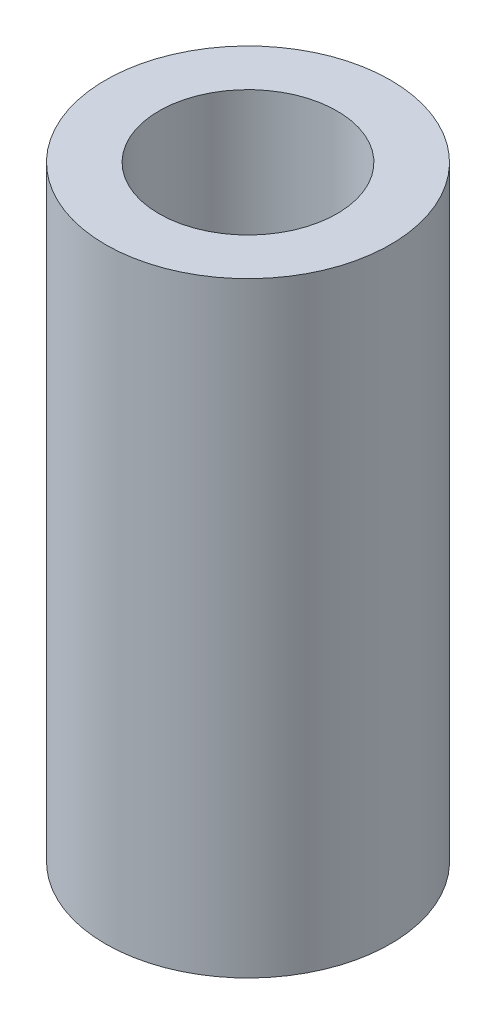
ISO-10303-21;
HEADER;
FILE_DESCRIPTION(('STEP AP214'),'2;1');
FILE_NAME('part.step','',(''),(''),'','','');
FILE_SCHEMA(('AUTOMOTIVE_DESIGN { 1 0 10303 214 1 1 1 1 }'));
ENDSEC;
DATA;
#1=APPLICATION_CONTEXT('core data for automotive mechanical design processes');
#2=APPLICATION_PROTOCOL_DEFINITION('international standard','automotive_design',2000,#1);
#3=PRODUCT_CONTEXT('',#1,'mechanical');
#4=PRODUCT('Part','Part','',(#3));
#5=PRODUCT_RELATED_PRODUCT_CATEGORY('part','',(#4));
#6=PRODUCT_DEFINITION_FORMATION('','',#4);
#7=PRODUCT_DEFINITION_CONTEXT('part definition',#1,'design');
#8=PRODUCT_DEFINITION('design','',#6,#7);
#9=PRODUCT_DEFINITION_SHAPE('','',#8);
#10=(LENGTH_UNIT() NAMED_UNIT(*) SI_UNIT(.MILLI.,.METRE.));
#11=(NAMED_UNIT(*) PLANE_ANGLE_UNIT() SI_UNIT($,.RADIAN.));
#12=(NAMED_UNIT(*) SI_UNIT($,.STERADIAN.) SOLID_ANGLE_UNIT());
#13=UNCERTAINTY_MEASURE_WITH_UNIT(LENGTH_MEASURE(1.E-05),#10,'distance_accuracy_value','');
#14=(GEOMETRIC_REPRESENTATION_CONTEXT(3) GLOBAL_UNCERTAINTY_ASSIGNED_CONTEXT((#13)) GLOBAL_UNIT_ASSIGNED_CONTEXT((#10,
#11,#12)) REPRESENTATION_CONTEXT('',''));
#15=CARTESIAN_POINT('',(0.,0.,0.));
#16=DIRECTION('',(0.,0.,1.));
#17=DIRECTION('',(1.,0.,0.));
#18=AXIS2_PLACEMENT_3D('',#15,#16,#17);
#19=CARTESIAN_POINT('',(0.,17.,0.));
#20=DIRECTION('',(0.,1.,0.));
#21=DIRECTION('',(0.,0.,1.));
#22=AXIS2_PLACEMENT_3D('',#19,#20,#21);
#23=PLANE('',#22);
#24=CARTESIAN_POINT('',(0.,17.,0.));
#25=DIRECTION('',(0.,1.,0.));
#26=DIRECTION('',(0.,0.,1.));
#27=AXIS2_PLACEMENT_3D('',#24,#25,#26);
#28=CIRCLE('',#27,4.);
#29=CARTESIAN_POINT('',(0.,17.,4.));
#30=VERTEX_POINT('',#29);
#31=EDGE_CURVE('E11',#30,#30,#28,.T.);
#32=ORIENTED_EDGE('',*,*,#31,.T.);
#33=EDGE_LOOP('',(#32));
#34=FACE_BOUND('',#33,.T.);
#35=CARTESIAN_POINT('',(0.,17.,0.));
#36=DIRECTION('',(0.,1.,0.));
#37=DIRECTION('',(0.,0.,1.));
#38=AXIS2_PLACEMENT_3D('',#35,#36,#37);
#39=CIRCLE('',#38,2.5);
#40=CARTESIAN_POINT('',(0.,17.,2.5));
#41=VERTEX_POINT('',#40);
#42=EDGE_CURVE('E51',#41,#41,#39,.T.);
#43=ORIENTED_EDGE('',*,*,#42,.F.);
#44=EDGE_LOOP('',(#43));
#45=FACE_BOUND('',#44,.T.);
#46=ADVANCED_FACE('F40',(#34,#45),#23,.T.);
#47=CARTESIAN_POINT('',(0.,0.,0.));
#48=DIRECTION('',(0.,1.,0.));
#49=DIRECTION('',(0.,0.,1.));
#50=AXIS2_PLACEMENT_3D('',#47,#48,#49);
#51=PLANE('',#50);
#52=CARTESIAN_POINT('',(0.,0.,0.));
#53=DIRECTION('',(0.,1.,0.));
#54=DIRECTION('',(0.,0.,1.));
#55=AXIS2_PLACEMENT_3D('',#52,#53,#54);
#56=CIRCLE('',#55,4.);
#57=CARTESIAN_POINT('',(0.,0.,4.));
#58=VERTEX_POINT('',#57);
#59=EDGE_CURVE('E44',#58,#58,#56,.T.);
#60=ORIENTED_EDGE('',*,*,#59,.F.);
#61=EDGE_LOOP('',(#60));
#62=FACE_BOUND('',#61,.T.);
#63=CARTESIAN_POINT('',(0.,0.,0.));
#64=DIRECTION('',(0.,1.,0.));
#65=DIRECTION('',(0.,0.,1.));
#66=AXIS2_PLACEMENT_3D('',#63,#64,#65);
#67=CIRCLE('',#66,2.5);
#68=CARTESIAN_POINT('',(0.,0.,2.5));
#69=VERTEX_POINT('',#68);
#70=EDGE_CURVE('E53',#69,#69,#67,.T.);
#71=ORIENTED_EDGE('',*,*,#70,.T.);
#72=EDGE_LOOP('',(#71));
#73=FACE_BOUND('',#72,.T.);
#74=ADVANCED_FACE('F63',(#62,#73),#51,.F.);
#75=CARTESIAN_POINT('',(0.,17.,0.));
#76=DIRECTION('',(0.,-1.,0.));
#77=DIRECTION('',(0.,0.,-1.));
#78=AXIS2_PLACEMENT_3D('',#75,#76,#77);
#79=CYLINDRICAL_SURFACE('',#78,4.);
#80=ORIENTED_EDGE('',*,*,#31,.F.);
#81=EDGE_LOOP('',(#80));
#82=FACE_BOUND('',#81,.T.);
#83=ORIENTED_EDGE('',*,*,#59,.T.);
#84=EDGE_LOOP('',(#83));
#85=FACE_BOUND('',#84,.T.);
#86=ADVANCED_FACE('F42',(#82,#85),#79,.T.);
#87=CARTESIAN_POINT('',(0.,17.,0.));
#88=DIRECTION('',(0.,-1.,0.));
#89=DIRECTION('',(0.,0.,-1.));
#90=AXIS2_PLACEMENT_3D('',#87,#88,#89);
#91=CYLINDRICAL_SURFACE('',#90,2.5);
#92=ORIENTED_EDGE('',*,*,#42,.T.);
#93=EDGE_LOOP('',(#92));
#94=FACE_BOUND('',#93,.T.);
#95=ORIENTED_EDGE('',*,*,#70,.F.);
#96=EDGE_LOOP('',(#95));
#97=FACE_BOUND('',#96,.T.);
#98=ADVANCED_FACE('F59',(#94,#97),#91,.F.);
#99=CLOSED_SHELL('',(#46,#74,#86,#98));
#100=MANIFOLD_SOLID_BREP('B2',#99);
#101=ADVANCED_BREP_SHAPE_REPRESENTATION('',(#18,#100),#14);
#102=SHAPE_DEFINITION_REPRESENTATION(#9,#101);
ENDSEC;
END-ISO-10303-21;
